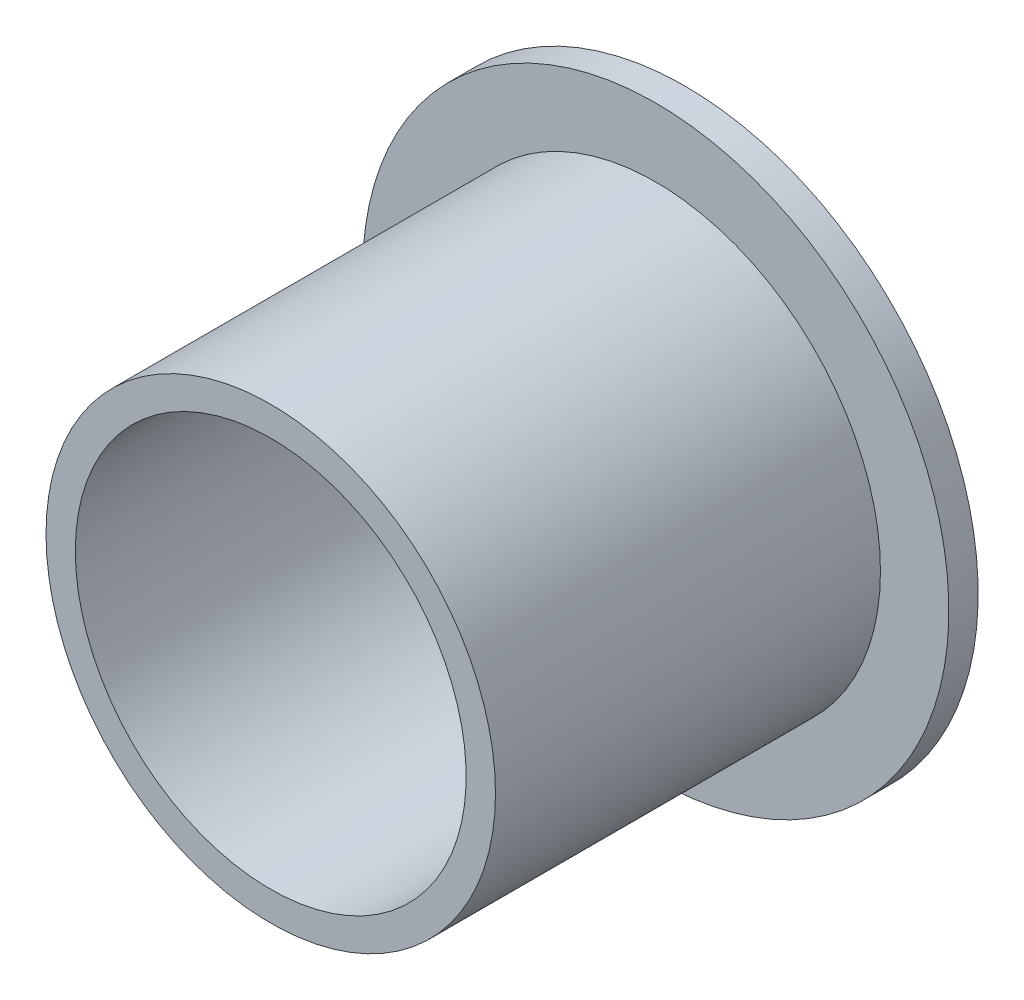
ISO-10303-21;
HEADER;
FILE_DESCRIPTION(('STEP AP214'),'2;1');
FILE_NAME('part.step','',(''),(''),'','','');
FILE_SCHEMA(('AUTOMOTIVE_DESIGN { 1 0 10303 214 1 1 1 1 }'));
ENDSEC;
DATA;
#1=APPLICATION_CONTEXT('core data for automotive mechanical design processes');
#2=APPLICATION_PROTOCOL_DEFINITION('international standard','automotive_design',2000,#1);
#3=PRODUCT_CONTEXT('',#1,'mechanical');
#4=PRODUCT('Part','Part','',(#3));
#5=PRODUCT_RELATED_PRODUCT_CATEGORY('part','',(#4));
#6=PRODUCT_DEFINITION_FORMATION('','',#4);
#7=PRODUCT_DEFINITION_CONTEXT('part definition',#1,'design');
#8=PRODUCT_DEFINITION('design','',#6,#7);
#9=PRODUCT_DEFINITION_SHAPE('','',#8);
#10=(LENGTH_UNIT() NAMED_UNIT(*) SI_UNIT(.MILLI.,.METRE.));
#11=(NAMED_UNIT(*) PLANE_ANGLE_UNIT() SI_UNIT($,.RADIAN.));
#12=(NAMED_UNIT(*) SI_UNIT($,.STERADIAN.) SOLID_ANGLE_UNIT());
#13=UNCERTAINTY_MEASURE_WITH_UNIT(LENGTH_MEASURE(1.E-05),#10,'distance_accuracy_value','');
#14=(GEOMETRIC_REPRESENTATION_CONTEXT(3) GLOBAL_UNCERTAINTY_ASSIGNED_CONTEXT((#13)) GLOBAL_UNIT_ASSIGNED_CONTEXT((#10,
#11,#12)) REPRESENTATION_CONTEXT('',''));
#15=CARTESIAN_POINT('',(0.,0.,0.));
#16=DIRECTION('',(0.,0.,1.));
#17=DIRECTION('',(1.,0.,0.));
#18=AXIS2_PLACEMENT_3D('',#15,#16,#17);
#19=CARTESIAN_POINT('',(0.,10.,-1.5));
#20=DIRECTION('',(0.,0.,-1.));
#21=DIRECTION('',(-1.,0.,0.));
#22=AXIS2_PLACEMENT_3D('',#19,#20,#21);
#23=PLANE('',#22);
#24=CARTESIAN_POINT('',(0.,0.,-1.5));
#25=DIRECTION('',(0.,0.,-1.));
#26=DIRECTION('',(-1.,0.,0.));
#27=AXIS2_PLACEMENT_3D('',#24,#25,#26);
#28=CIRCLE('',#27,15.);
#29=CARTESIAN_POINT('',(-15.,0.,-1.5));
#30=VERTEX_POINT('',#29);
#31=EDGE_CURVE('E10',#30,#30,#28,.T.);
#32=ORIENTED_EDGE('',*,*,#31,.T.);
#33=EDGE_LOOP('',(#32));
#34=FACE_BOUND('',#33,.T.);
#35=CARTESIAN_POINT('',(0.,0.,-1.5));
#36=DIRECTION('',(0.,0.,-1.));
#37=DIRECTION('',(-1.,0.,0.));
#38=AXIS2_PLACEMENT_3D('',#35,#36,#37);
#39=CIRCLE('',#38,10.);
#40=CARTESIAN_POINT('',(-10.,0.,-1.5));
#41=VERTEX_POINT('',#40);
#42=EDGE_CURVE('E54',#41,#41,#39,.T.);
#43=ORIENTED_EDGE('',*,*,#42,.F.);
#44=EDGE_LOOP('',(#43));
#45=FACE_BOUND('',#44,.T.);
#46=ADVANCED_FACE('F32',(#34,#45),#23,.T.);
#47=CARTESIAN_POINT('',(0.,0.,0.));
#48=DIRECTION('',(0.,0.,-1.));
#49=DIRECTION('',(-1.,0.,0.));
#50=AXIS2_PLACEMENT_3D('',#47,#48,#49);
#51=CYLINDRICAL_SURFACE('',#50,15.);
#52=CARTESIAN_POINT('',(0.,0.,0.));
#53=DIRECTION('',(0.,0.,-1.));
#54=DIRECTION('',(-1.,0.,0.));
#55=AXIS2_PLACEMENT_3D('',#52,#53,#54);
#56=CIRCLE('',#55,15.);
#57=CARTESIAN_POINT('',(-15.,0.,0.));
#58=VERTEX_POINT('',#57);
#59=EDGE_CURVE('E38',#58,#58,#56,.T.);
#60=ORIENTED_EDGE('',*,*,#59,.T.);
#61=EDGE_LOOP('',(#60));
#62=FACE_BOUND('',#61,.T.);
#63=ORIENTED_EDGE('',*,*,#31,.F.);
#64=EDGE_LOOP('',(#63));
#65=FACE_BOUND('',#64,.T.);
#66=ADVANCED_FACE('F62',(#62,#65),#51,.T.);
#67=CARTESIAN_POINT('',(0.,15.,0.));
#68=DIRECTION('',(0.,0.,1.));
#69=DIRECTION('',(1.,0.,0.));
#70=AXIS2_PLACEMENT_3D('',#67,#68,#69);
#71=PLANE('',#70);
#72=CARTESIAN_POINT('',(0.,0.,0.));
#73=DIRECTION('',(0.,0.,-1.));
#74=DIRECTION('',(-1.,0.,0.));
#75=AXIS2_PLACEMENT_3D('',#72,#73,#74);
#76=CIRCLE('',#75,11.5);
#77=CARTESIAN_POINT('',(-11.5,0.,0.));
#78=VERTEX_POINT('',#77);
#79=EDGE_CURVE('E42',#78,#78,#76,.T.);
#80=ORIENTED_EDGE('',*,*,#79,.T.);
#81=EDGE_LOOP('',(#80));
#82=FACE_BOUND('',#81,.T.);
#83=ORIENTED_EDGE('',*,*,#59,.F.);
#84=EDGE_LOOP('',(#83));
#85=FACE_BOUND('',#84,.T.);
#86=ADVANCED_FACE('F66',(#82,#85),#71,.T.);
#87=CARTESIAN_POINT('',(0.,0.,0.));
#88=DIRECTION('',(0.,0.,-1.));
#89=DIRECTION('',(-1.,0.,0.));
#90=AXIS2_PLACEMENT_3D('',#87,#88,#89);
#91=CYLINDRICAL_SURFACE('',#90,11.5);
#92=CARTESIAN_POINT('',(0.,0.,19.7));
#93=DIRECTION('',(0.,0.,-1.));
#94=DIRECTION('',(-1.,0.,0.));
#95=AXIS2_PLACEMENT_3D('',#92,#93,#94);
#96=CIRCLE('',#95,11.5);
#97=CARTESIAN_POINT('',(-11.5,0.,19.7));
#98=VERTEX_POINT('',#97);
#99=EDGE_CURVE('E46',#98,#98,#96,.T.);
#100=ORIENTED_EDGE('',*,*,#99,.T.);
#101=EDGE_LOOP('',(#100));
#102=FACE_BOUND('',#101,.T.);
#103=ORIENTED_EDGE('',*,*,#79,.F.);
#104=EDGE_LOOP('',(#103));
#105=FACE_BOUND('',#104,.T.);
#106=ADVANCED_FACE('F70',(#102,#105),#91,.T.);
#107=CARTESIAN_POINT('',(0.,10.,19.7));
#108=DIRECTION('',(0.,0.,1.));
#109=DIRECTION('',(1.,0.,0.));
#110=AXIS2_PLACEMENT_3D('',#107,#108,#109);
#111=PLANE('',#110);
#112=CARTESIAN_POINT('',(0.,0.,19.7));
#113=DIRECTION('',(0.,0.,-1.));
#114=DIRECTION('',(-1.,0.,0.));
#115=AXIS2_PLACEMENT_3D('',#112,#113,#114);
#116=CIRCLE('',#115,10.);
#117=CARTESIAN_POINT('',(-10.,0.,19.7));
#118=VERTEX_POINT('',#117);
#119=EDGE_CURVE('E51',#118,#118,#116,.T.);
#120=ORIENTED_EDGE('',*,*,#119,.T.);
#121=EDGE_LOOP('',(#120));
#122=FACE_BOUND('',#121,.T.);
#123=ORIENTED_EDGE('',*,*,#99,.F.);
#124=EDGE_LOOP('',(#123));
#125=FACE_BOUND('',#124,.T.);
#126=ADVANCED_FACE('F77',(#122,#125),#111,.T.);
#127=CARTESIAN_POINT('',(0.,0.,0.));
#128=DIRECTION('',(0.,0.,-1.));
#129=DIRECTION('',(-1.,0.,0.));
#130=AXIS2_PLACEMENT_3D('',#127,#128,#129);
#131=CYLINDRICAL_SURFACE('',#130,10.);
#132=ORIENTED_EDGE('',*,*,#42,.T.);
#133=EDGE_LOOP('',(#132));
#134=FACE_BOUND('',#133,.T.);
#135=ORIENTED_EDGE('',*,*,#119,.F.);
#136=EDGE_LOOP('',(#135));
#137=FACE_BOUND('',#136,.T.);
#138=ADVANCED_FACE('F58',(#134,#137),#131,.F.);
#139=CLOSED_SHELL('',(#46,#66,#86,#106,#126,#138));
#140=MANIFOLD_SOLID_BREP('B2',#139);
#141=ADVANCED_BREP_SHAPE_REPRESENTATION('',(#18,#140),#14);
#142=SHAPE_DEFINITION_REPRESENTATION(#9,#141);
ENDSEC;
END-ISO-10303-21;
